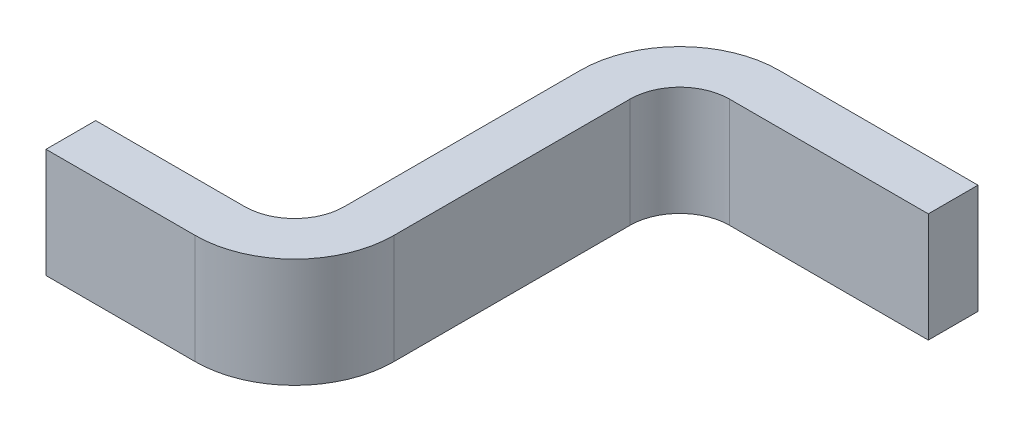
ISO-10303-21;
HEADER;
FILE_DESCRIPTION(('STEP AP214'),'2;1');
FILE_NAME('part.step','',(''),(''),'','','');
FILE_SCHEMA(('AUTOMOTIVE_DESIGN { 1 0 10303 214 1 1 1 1 }'));
ENDSEC;
DATA;
#1=APPLICATION_CONTEXT('core data for automotive mechanical design processes');
#2=APPLICATION_PROTOCOL_DEFINITION('international standard','automotive_design',2000,#1);
#3=PRODUCT_CONTEXT('',#1,'mechanical');
#4=PRODUCT('Part','Part','',(#3));
#5=PRODUCT_RELATED_PRODUCT_CATEGORY('part','',(#4));
#6=PRODUCT_DEFINITION_FORMATION('','',#4);
#7=PRODUCT_DEFINITION_CONTEXT('part definition',#1,'design');
#8=PRODUCT_DEFINITION('design','',#6,#7);
#9=PRODUCT_DEFINITION_SHAPE('','',#8);
#10=(LENGTH_UNIT() NAMED_UNIT(*) SI_UNIT(.MILLI.,.METRE.));
#11=(NAMED_UNIT(*) PLANE_ANGLE_UNIT() SI_UNIT($,.RADIAN.));
#12=(NAMED_UNIT(*) SI_UNIT($,.STERADIAN.) SOLID_ANGLE_UNIT());
#13=UNCERTAINTY_MEASURE_WITH_UNIT(LENGTH_MEASURE(1.E-05),#10,'distance_accuracy_value','');
#14=(GEOMETRIC_REPRESENTATION_CONTEXT(3) GLOBAL_UNCERTAINTY_ASSIGNED_CONTEXT((#13)) GLOBAL_UNIT_ASSIGNED_CONTEXT((#10,
#11,#12)) REPRESENTATION_CONTEXT('',''));
#15=CARTESIAN_POINT('',(0.,0.,0.));
#16=DIRECTION('',(0.,0.,1.));
#17=DIRECTION('',(1.,0.,0.));
#18=AXIS2_PLACEMENT_3D('',#15,#16,#17);
#19=CARTESIAN_POINT('',(3.9,0.36,0.675));
#20=DIRECTION('',(0.,-1.,0.));
#21=DIRECTION('',(0.,0.,-1.));
#22=AXIS2_PLACEMENT_3D('',#19,#20,#21);
#23=PLANE('',#22);
#24=CARTESIAN_POINT('',(3.8,0.36,0.675));
#25=DIRECTION('',(0.,-1.,0.));
#26=DIRECTION('',(0.,0.,-1.));
#27=AXIS2_PLACEMENT_3D('',#24,#25,#26);
#28=CIRCLE('',#27,0.1);
#29=CARTESIAN_POINT('',(3.9,0.36,0.675));
#30=VERTEX_POINT('',#29);
#31=CARTESIAN_POINT('',(3.8,0.36,0.775));
#32=VERTEX_POINT('',#31);
#33=EDGE_CURVE('E162',#30,#32,#28,.T.);
#34=ORIENTED_EDGE('',*,*,#33,.T.);
#35=DIRECTION('',(1.,0.,0.));
#36=VECTOR('',#35,1.);
#37=CARTESIAN_POINT('',(3.5,0.36,0.775));
#38=LINE('',#37,#36);
#39=CARTESIAN_POINT('',(3.5,0.36,0.775));
#40=VERTEX_POINT('',#39);
#41=EDGE_CURVE('E120',#32,#40,#38,.F.);
#42=ORIENTED_EDGE('',*,*,#41,.T.);
#43=DIRECTION('',(0.,0.,1.));
#44=VECTOR('',#43,1.);
#45=CARTESIAN_POINT('',(3.5,0.36,0.775));
#46=LINE('',#45,#44);
#47=CARTESIAN_POINT('',(3.5,0.36,0.875));
#48=VERTEX_POINT('',#47);
#49=EDGE_CURVE('E116',#48,#40,#46,.F.);
#50=ORIENTED_EDGE('',*,*,#49,.F.);
#51=DIRECTION('',(-1.,0.,0.));
#52=VECTOR('',#51,1.);
#53=CARTESIAN_POINT('',(3.5,0.36,0.875));
#54=LINE('',#53,#52);
#55=CARTESIAN_POINT('',(3.8,0.36,0.875));
#56=VERTEX_POINT('',#55);
#57=EDGE_CURVE('E111',#48,#56,#54,.F.);
#58=ORIENTED_EDGE('',*,*,#57,.T.);
#59=CARTESIAN_POINT('',(3.8,0.36,0.675));
#60=DIRECTION('',(0.,-1.,0.));
#61=DIRECTION('',(0.,0.,-1.));
#62=AXIS2_PLACEMENT_3D('',#59,#60,#61);
#63=CIRCLE('',#62,0.2);
#64=CARTESIAN_POINT('',(4.,0.36,0.675));
#65=VERTEX_POINT('',#64);
#66=EDGE_CURVE('E102',#65,#56,#63,.T.);
#67=ORIENTED_EDGE('',*,*,#66,.F.);
#68=DIRECTION('',(0.,0.,1.));
#69=VECTOR('',#68,1.);
#70=CARTESIAN_POINT('',(4.,0.36,0.675));
#71=LINE('',#70,#69);
#72=CARTESIAN_POINT('',(4.,0.36,0.2));
#73=VERTEX_POINT('',#72);
#74=EDGE_CURVE('E98',#65,#73,#71,.F.);
#75=ORIENTED_EDGE('',*,*,#74,.T.);
#76=CARTESIAN_POINT('',(4.1,0.36,0.2));
#77=DIRECTION('',(0.,1.,0.));
#78=DIRECTION('',(0.,0.,1.));
#79=AXIS2_PLACEMENT_3D('',#76,#77,#78);
#80=CIRCLE('',#79,0.1);
#81=CARTESIAN_POINT('',(4.1,0.36,0.1));
#82=VERTEX_POINT('',#81);
#83=EDGE_CURVE('E20',#73,#82,#80,.F.);
#84=ORIENTED_EDGE('',*,*,#83,.T.);
#85=DIRECTION('',(-1.,0.,0.));
#86=VECTOR('',#85,1.);
#87=CARTESIAN_POINT('',(4.1,0.36,0.1));
#88=LINE('',#87,#86);
#89=CARTESIAN_POINT('',(4.5,0.36,0.1));
#90=VERTEX_POINT('',#89);
#91=EDGE_CURVE('E145',#82,#90,#88,.F.);
#92=ORIENTED_EDGE('',*,*,#91,.T.);
#93=DIRECTION('',(0.,0.,1.));
#94=VECTOR('',#93,1.);
#95=CARTESIAN_POINT('',(4.5,0.36,0.));
#96=LINE('',#95,#94);
#97=CARTESIAN_POINT('',(4.5,0.36,0.));
#98=VERTEX_POINT('',#97);
#99=EDGE_CURVE('E139',#90,#98,#96,.F.);
#100=ORIENTED_EDGE('',*,*,#99,.T.);
#101=DIRECTION('',(1.,0.,0.));
#102=VECTOR('',#101,1.);
#103=CARTESIAN_POINT('',(4.1,0.36,0.));
#104=LINE('',#103,#102);
#105=CARTESIAN_POINT('',(4.1,0.36,0.));
#106=VERTEX_POINT('',#105);
#107=EDGE_CURVE('E132',#98,#106,#104,.F.);
#108=ORIENTED_EDGE('',*,*,#107,.T.);
#109=CARTESIAN_POINT('',(4.1,0.36,0.2));
#110=DIRECTION('',(0.,1.,0.));
#111=DIRECTION('',(0.,0.,1.));
#112=AXIS2_PLACEMENT_3D('',#109,#110,#111);
#113=CIRCLE('',#112,0.2);
#114=CARTESIAN_POINT('',(3.9,0.36,0.2));
#115=VERTEX_POINT('',#114);
#116=EDGE_CURVE('E135',#115,#106,#113,.F.);
#117=ORIENTED_EDGE('',*,*,#116,.F.);
#118=DIRECTION('',(0.,0.,-1.));
#119=VECTOR('',#118,1.);
#120=CARTESIAN_POINT('',(3.9,0.36,0.675));
#121=LINE('',#120,#119);
#122=EDGE_CURVE('E128',#115,#30,#121,.F.);
#123=ORIENTED_EDGE('',*,*,#122,.T.);
#124=EDGE_LOOP('',(#34,#42,#50,#58,#67,#75,#84,#92,#100,#108,#117,#123));
#125=FACE_BOUND('',#124,.T.);
#126=ADVANCED_FACE('F17',(#125),#23,.F.);
#127=CARTESIAN_POINT('',(4.1,0.36,0.2));
#128=DIRECTION('',(0.,1.,0.));
#129=DIRECTION('',(0.,0.,1.));
#130=AXIS2_PLACEMENT_3D('',#127,#128,#129);
#131=CYLINDRICAL_SURFACE('',#130,0.1);
#132=DIRECTION('',(0.,1.,0.));
#133=VECTOR('',#132,1.);
#134=CARTESIAN_POINT('',(4.,0.36,0.2));
#135=LINE('',#134,#133);
#136=CARTESIAN_POINT('',(4.,0.14,0.2));
#137=VERTEX_POINT('',#136);
#138=EDGE_CURVE('E91',#73,#137,#135,.F.);
#139=ORIENTED_EDGE('',*,*,#138,.T.);
#140=CARTESIAN_POINT('',(4.1,0.14,0.2));
#141=DIRECTION('',(0.,1.,0.));
#142=DIRECTION('',(0.,0.,1.));
#143=AXIS2_PLACEMENT_3D('',#140,#141,#142);
#144=CIRCLE('',#143,0.1);
#145=CARTESIAN_POINT('',(4.1,0.14,0.1));
#146=VERTEX_POINT('',#145);
#147=EDGE_CURVE('E103',#137,#146,#144,.F.);
#148=ORIENTED_EDGE('',*,*,#147,.T.);
#149=DIRECTION('',(0.,1.,0.));
#150=VECTOR('',#149,1.);
#151=CARTESIAN_POINT('',(4.1,0.36,0.1));
#152=LINE('',#151,#150);
#153=EDGE_CURVE('E92',#146,#82,#152,.T.);
#154=ORIENTED_EDGE('',*,*,#153,.T.);
#155=ORIENTED_EDGE('',*,*,#83,.F.);
#156=EDGE_LOOP('',(#139,#148,#154,#155));
#157=FACE_BOUND('',#156,.T.);
#158=ADVANCED_FACE('F89',(#157),#131,.F.);
#159=CARTESIAN_POINT('',(4.1,0.36,0.1));
#160=DIRECTION('',(0.,0.,-1.));
#161=DIRECTION('',(-1.,0.,0.));
#162=AXIS2_PLACEMENT_3D('',#159,#160,#161);
#163=PLANE('',#162);
#164=ORIENTED_EDGE('',*,*,#153,.F.);
#165=DIRECTION('',(1.,0.,0.));
#166=VECTOR('',#165,1.);
#167=CARTESIAN_POINT('',(4.,0.14,0.1));
#168=LINE('',#167,#166);
#169=CARTESIAN_POINT('',(4.5,0.14,0.1));
#170=VERTEX_POINT('',#169);
#171=EDGE_CURVE('E105',#146,#170,#168,.T.);
#172=ORIENTED_EDGE('',*,*,#171,.T.);
#173=DIRECTION('',(0.,1.,0.));
#174=VECTOR('',#173,1.);
#175=CARTESIAN_POINT('',(4.5,0.14,0.1));
#176=LINE('',#175,#174);
#177=EDGE_CURVE('E142',#170,#90,#176,.T.);
#178=ORIENTED_EDGE('',*,*,#177,.T.);
#179=ORIENTED_EDGE('',*,*,#91,.F.);
#180=EDGE_LOOP('',(#164,#172,#178,#179));
#181=FACE_BOUND('',#180,.T.);
#182=ADVANCED_FACE('F187',(#181),#163,.F.);
#183=CARTESIAN_POINT('',(4.5,0.14,0.));
#184=DIRECTION('',(-1.,0.,0.));
#185=DIRECTION('',(0.,0.,1.));
#186=AXIS2_PLACEMENT_3D('',#183,#184,#185);
#187=PLANE('',#186);
#188=ORIENTED_EDGE('',*,*,#177,.F.);
#189=DIRECTION('',(0.,0.,1.));
#190=VECTOR('',#189,1.);
#191=CARTESIAN_POINT('',(4.5,0.14,0.675));
#192=LINE('',#191,#190);
#193=CARTESIAN_POINT('',(4.5,0.14,0.));
#194=VERTEX_POINT('',#193);
#195=EDGE_CURVE('E176',#170,#194,#192,.F.);
#196=ORIENTED_EDGE('',*,*,#195,.T.);
#197=DIRECTION('',(0.,1.,0.));
#198=VECTOR('',#197,1.);
#199=CARTESIAN_POINT('',(4.5,0.14,0.));
#200=LINE('',#199,#198);
#201=EDGE_CURVE('E136',#194,#98,#200,.T.);
#202=ORIENTED_EDGE('',*,*,#201,.T.);
#203=ORIENTED_EDGE('',*,*,#99,.F.);
#204=EDGE_LOOP('',(#188,#196,#202,#203));
#205=FACE_BOUND('',#204,.T.);
#206=ADVANCED_FACE('F192',(#205),#187,.F.);
#207=CARTESIAN_POINT('',(4.1,0.14,0.));
#208=DIRECTION('',(0.,0.,1.));
#209=DIRECTION('',(1.,0.,0.));
#210=AXIS2_PLACEMENT_3D('',#207,#208,#209);
#211=PLANE('',#210);
#212=DIRECTION('',(0.,1.,0.));
#213=VECTOR('',#212,1.);
#214=CARTESIAN_POINT('',(4.1,0.14,0.));
#215=LINE('',#214,#213);
#216=CARTESIAN_POINT('',(4.1,0.14,0.));
#217=VERTEX_POINT('',#216);
#218=EDGE_CURVE('E163',#106,#217,#215,.F.);
#219=ORIENTED_EDGE('',*,*,#218,.F.);
#220=ORIENTED_EDGE('',*,*,#107,.F.);
#221=ORIENTED_EDGE('',*,*,#201,.F.);
#222=DIRECTION('',(1.,0.,0.));
#223=VECTOR('',#222,1.);
#224=CARTESIAN_POINT('',(4.,0.14,0.));
#225=LINE('',#224,#223);
#226=EDGE_CURVE('E159',#194,#217,#225,.F.);
#227=ORIENTED_EDGE('',*,*,#226,.T.);
#228=EDGE_LOOP('',(#219,#220,#221,#227));
#229=FACE_BOUND('',#228,.T.);
#230=ADVANCED_FACE('F264',(#229),#211,.F.);
#231=CARTESIAN_POINT('',(4.1,0.14,0.2));
#232=DIRECTION('',(0.,1.,0.));
#233=DIRECTION('',(0.,0.,1.));
#234=AXIS2_PLACEMENT_3D('',#231,#232,#233);
#235=CYLINDRICAL_SURFACE('',#234,0.2);
#236=ORIENTED_EDGE('',*,*,#116,.T.);
#237=ORIENTED_EDGE('',*,*,#218,.T.);
#238=CARTESIAN_POINT('',(4.1,0.14,0.2));
#239=DIRECTION('',(0.,1.,0.));
#240=DIRECTION('',(0.,0.,1.));
#241=AXIS2_PLACEMENT_3D('',#238,#239,#240);
#242=CIRCLE('',#241,0.2);
#243=CARTESIAN_POINT('',(3.9,0.14,0.2));
#244=VERTEX_POINT('',#243);
#245=EDGE_CURVE('E157',#217,#244,#242,.T.);
#246=ORIENTED_EDGE('',*,*,#245,.T.);
#247=DIRECTION('',(0.,1.,0.));
#248=VECTOR('',#247,1.);
#249=CARTESIAN_POINT('',(3.9,0.14,0.2));
#250=LINE('',#249,#248);
#251=EDGE_CURVE('E131',#244,#115,#250,.T.);
#252=ORIENTED_EDGE('',*,*,#251,.T.);
#253=EDGE_LOOP('',(#236,#237,#246,#252));
#254=FACE_BOUND('',#253,.T.);
#255=ADVANCED_FACE('F266',(#254),#235,.T.);
#256=CARTESIAN_POINT('',(3.9,0.14,0.675));
#257=DIRECTION('',(1.,0.,0.));
#258=DIRECTION('',(0.,0.,-1.));
#259=AXIS2_PLACEMENT_3D('',#256,#257,#258);
#260=PLANE('',#259);
#261=DIRECTION('',(0.,-1.,0.));
#262=VECTOR('',#261,1.);
#263=CARTESIAN_POINT('',(3.9,0.14,0.675));
#264=LINE('',#263,#262);
#265=CARTESIAN_POINT('',(3.9,0.14,0.675));
#266=VERTEX_POINT('',#265);
#267=EDGE_CURVE('E130',#266,#30,#264,.F.);
#268=ORIENTED_EDGE('',*,*,#267,.T.);
#269=ORIENTED_EDGE('',*,*,#122,.F.);
#270=ORIENTED_EDGE('',*,*,#251,.F.);
#271=DIRECTION('',(0.,0.,1.));
#272=VECTOR('',#271,1.);
#273=CARTESIAN_POINT('',(3.9,0.14,0.675));
#274=LINE('',#273,#272);
#275=EDGE_CURVE('E156',#244,#266,#274,.T.);
#276=ORIENTED_EDGE('',*,*,#275,.T.);
#277=EDGE_LOOP('',(#268,#269,#270,#276));
#278=FACE_BOUND('',#277,.T.);
#279=ADVANCED_FACE('F231',(#278),#260,.F.);
#280=CARTESIAN_POINT('',(3.8,0.14,0.675));
#281=DIRECTION('',(0.,-1.,0.));
#282=DIRECTION('',(0.,0.,-1.));
#283=AXIS2_PLACEMENT_3D('',#280,#281,#282);
#284=CYLINDRICAL_SURFACE('',#283,0.1);
#285=DIRECTION('',(0.,1.,0.));
#286=VECTOR('',#285,1.);
#287=CARTESIAN_POINT('',(3.8,0.14,0.775));
#288=LINE('',#287,#286);
#289=CARTESIAN_POINT('',(3.8,0.14,0.775));
#290=VERTEX_POINT('',#289);
#291=EDGE_CURVE('E125',#290,#32,#288,.T.);
#292=ORIENTED_EDGE('',*,*,#291,.T.);
#293=ORIENTED_EDGE('',*,*,#33,.F.);
#294=ORIENTED_EDGE('',*,*,#267,.F.);
#295=CARTESIAN_POINT('',(3.8,0.14,0.675));
#296=DIRECTION('',(0.,-1.,0.));
#297=DIRECTION('',(0.,0.,-1.));
#298=AXIS2_PLACEMENT_3D('',#295,#296,#297);
#299=CIRCLE('',#298,0.1);
#300=EDGE_CURVE('E152',#266,#290,#299,.T.);
#301=ORIENTED_EDGE('',*,*,#300,.T.);
#302=EDGE_LOOP('',(#292,#293,#294,#301));
#303=FACE_BOUND('',#302,.T.);
#304=ADVANCED_FACE('F235',(#303),#284,.F.);
#305=CARTESIAN_POINT('',(3.5,0.14,0.775));
#306=DIRECTION('',(0.,0.,1.));
#307=DIRECTION('',(1.,0.,0.));
#308=AXIS2_PLACEMENT_3D('',#305,#306,#307);
#309=PLANE('',#308);
#310=DIRECTION('',(0.,1.,0.));
#311=VECTOR('',#310,1.);
#312=CARTESIAN_POINT('',(3.5,0.14,0.775));
#313=LINE('',#312,#311);
#314=CARTESIAN_POINT('',(3.5,0.14,0.775));
#315=VERTEX_POINT('',#314);
#316=EDGE_CURVE('E119',#40,#315,#313,.F.);
#317=ORIENTED_EDGE('',*,*,#316,.F.);
#318=ORIENTED_EDGE('',*,*,#41,.F.);
#319=ORIENTED_EDGE('',*,*,#291,.F.);
#320=DIRECTION('',(1.,0.,0.));
#321=VECTOR('',#320,1.);
#322=CARTESIAN_POINT('',(4.,0.14,0.775));
#323=LINE('',#322,#321);
#324=EDGE_CURVE('E155',#290,#315,#323,.F.);
#325=ORIENTED_EDGE('',*,*,#324,.T.);
#326=EDGE_LOOP('',(#317,#318,#319,#325));
#327=FACE_BOUND('',#326,.T.);
#328=ADVANCED_FACE('F259',(#327),#309,.F.);
#329=CARTESIAN_POINT('',(3.5,0.14,0.775));
#330=DIRECTION('',(-1.,0.,0.));
#331=DIRECTION('',(0.,0.,1.));
#332=AXIS2_PLACEMENT_3D('',#329,#330,#331);
#333=PLANE('',#332);
#334=DIRECTION('',(0.,0.,1.));
#335=VECTOR('',#334,1.);
#336=CARTESIAN_POINT('',(3.5,0.14,0.675));
#337=LINE('',#336,#335);
#338=CARTESIAN_POINT('',(3.5,0.14,0.875));
#339=VERTEX_POINT('',#338);
#340=EDGE_CURVE('E217',#315,#339,#337,.T.);
#341=ORIENTED_EDGE('',*,*,#340,.T.);
#342=DIRECTION('',(0.,1.,0.));
#343=VECTOR('',#342,1.);
#344=CARTESIAN_POINT('',(3.5,0.36,0.875));
#345=LINE('',#344,#343);
#346=EDGE_CURVE('E113',#339,#48,#345,.T.);
#347=ORIENTED_EDGE('',*,*,#346,.T.);
#348=ORIENTED_EDGE('',*,*,#49,.T.);
#349=ORIENTED_EDGE('',*,*,#316,.T.);
#350=EDGE_LOOP('',(#341,#347,#348,#349));
#351=FACE_BOUND('',#350,.T.);
#352=ADVANCED_FACE('F255',(#351),#333,.T.);
#353=CARTESIAN_POINT('',(3.5,0.36,0.875));
#354=DIRECTION('',(0.,0.,-1.));
#355=DIRECTION('',(-1.,0.,0.));
#356=AXIS2_PLACEMENT_3D('',#353,#354,#355);
#357=PLANE('',#356);
#358=ORIENTED_EDGE('',*,*,#346,.F.);
#359=DIRECTION('',(1.,0.,0.));
#360=VECTOR('',#359,1.);
#361=CARTESIAN_POINT('',(4.,0.14,0.875));
#362=LINE('',#361,#360);
#363=CARTESIAN_POINT('',(3.8,0.14,0.875));
#364=VERTEX_POINT('',#363);
#365=EDGE_CURVE('E151',#339,#364,#362,.T.);
#366=ORIENTED_EDGE('',*,*,#365,.T.);
#367=DIRECTION('',(0.,-1.,0.));
#368=VECTOR('',#367,1.);
#369=CARTESIAN_POINT('',(3.8,0.36,0.875));
#370=LINE('',#369,#368);
#371=EDGE_CURVE('E99',#56,#364,#370,.T.);
#372=ORIENTED_EDGE('',*,*,#371,.F.);
#373=ORIENTED_EDGE('',*,*,#57,.F.);
#374=EDGE_LOOP('',(#358,#366,#372,#373));
#375=FACE_BOUND('',#374,.T.);
#376=ADVANCED_FACE('F251',(#375),#357,.F.);
#377=CARTESIAN_POINT('',(3.8,0.36,0.675));
#378=DIRECTION('',(0.,-1.,0.));
#379=DIRECTION('',(0.,0.,-1.));
#380=AXIS2_PLACEMENT_3D('',#377,#378,#379);
#381=CYLINDRICAL_SURFACE('',#380,0.2);
#382=CARTESIAN_POINT('',(3.8,0.14,0.675));
#383=DIRECTION('',(0.,-1.,0.));
#384=DIRECTION('',(0.,0.,-1.));
#385=AXIS2_PLACEMENT_3D('',#382,#383,#384);
#386=CIRCLE('',#385,0.2);
#387=CARTESIAN_POINT('',(4.,0.14,0.675));
#388=VERTEX_POINT('',#387);
#389=EDGE_CURVE('E26',#364,#388,#386,.F.);
#390=ORIENTED_EDGE('',*,*,#389,.T.);
#391=DIRECTION('',(0.,1.,0.));
#392=VECTOR('',#391,1.);
#393=CARTESIAN_POINT('',(4.,0.36,0.675));
#394=LINE('',#393,#392);
#395=EDGE_CURVE('E34',#388,#65,#394,.T.);
#396=ORIENTED_EDGE('',*,*,#395,.T.);
#397=ORIENTED_EDGE('',*,*,#66,.T.);
#398=ORIENTED_EDGE('',*,*,#371,.T.);
#399=EDGE_LOOP('',(#390,#396,#397,#398));
#400=FACE_BOUND('',#399,.T.);
#401=ADVANCED_FACE('F280',(#400),#381,.T.);
#402=CARTESIAN_POINT('',(4.,0.36,0.675));
#403=DIRECTION('',(-1.,0.,0.));
#404=DIRECTION('',(0.,0.,1.));
#405=AXIS2_PLACEMENT_3D('',#402,#403,#404);
#406=PLANE('',#405);
#407=ORIENTED_EDGE('',*,*,#395,.F.);
#408=DIRECTION('',(0.,0.,1.));
#409=VECTOR('',#408,1.);
#410=CARTESIAN_POINT('',(4.,0.14,0.675));
#411=LINE('',#410,#409);
#412=EDGE_CURVE('E11',#388,#137,#411,.F.);
#413=ORIENTED_EDGE('',*,*,#412,.T.);
#414=ORIENTED_EDGE('',*,*,#138,.F.);
#415=ORIENTED_EDGE('',*,*,#74,.F.);
#416=EDGE_LOOP('',(#407,#413,#414,#415));
#417=FACE_BOUND('',#416,.T.);
#418=ADVANCED_FACE('F97',(#417),#406,.F.);
#419=CARTESIAN_POINT('',(4.,0.14,0.675));
#420=DIRECTION('',(0.,1.,0.));
#421=DIRECTION('',(0.,0.,1.));
#422=AXIS2_PLACEMENT_3D('',#419,#420,#421);
#423=PLANE('',#422);
#424=ORIENTED_EDGE('',*,*,#389,.F.);
#425=ORIENTED_EDGE('',*,*,#365,.F.);
#426=ORIENTED_EDGE('',*,*,#340,.F.);
#427=ORIENTED_EDGE('',*,*,#324,.F.);
#428=ORIENTED_EDGE('',*,*,#300,.F.);
#429=ORIENTED_EDGE('',*,*,#275,.F.);
#430=ORIENTED_EDGE('',*,*,#245,.F.);
#431=ORIENTED_EDGE('',*,*,#226,.F.);
#432=ORIENTED_EDGE('',*,*,#195,.F.);
#433=ORIENTED_EDGE('',*,*,#171,.F.);
#434=ORIENTED_EDGE('',*,*,#147,.F.);
#435=ORIENTED_EDGE('',*,*,#412,.F.);
#436=EDGE_LOOP('',(#424,#425,#426,#427,#428,#429,#430,#431,#432,#433,#434,#435));
#437=FACE_BOUND('',#436,.T.);
#438=ADVANCED_FACE('F197',(#437),#423,.F.);
#439=CLOSED_SHELL('',(#126,#158,#182,#206,#230,#255,#279,#304,#328,#352,#376,#401,#418,#438));
#440=MANIFOLD_SOLID_BREP('B1',#439);
#441=ADVANCED_BREP_SHAPE_REPRESENTATION('',(#18,#440),#14);
#442=SHAPE_DEFINITION_REPRESENTATION(#9,#441);
ENDSEC;
END-ISO-10303-21;
